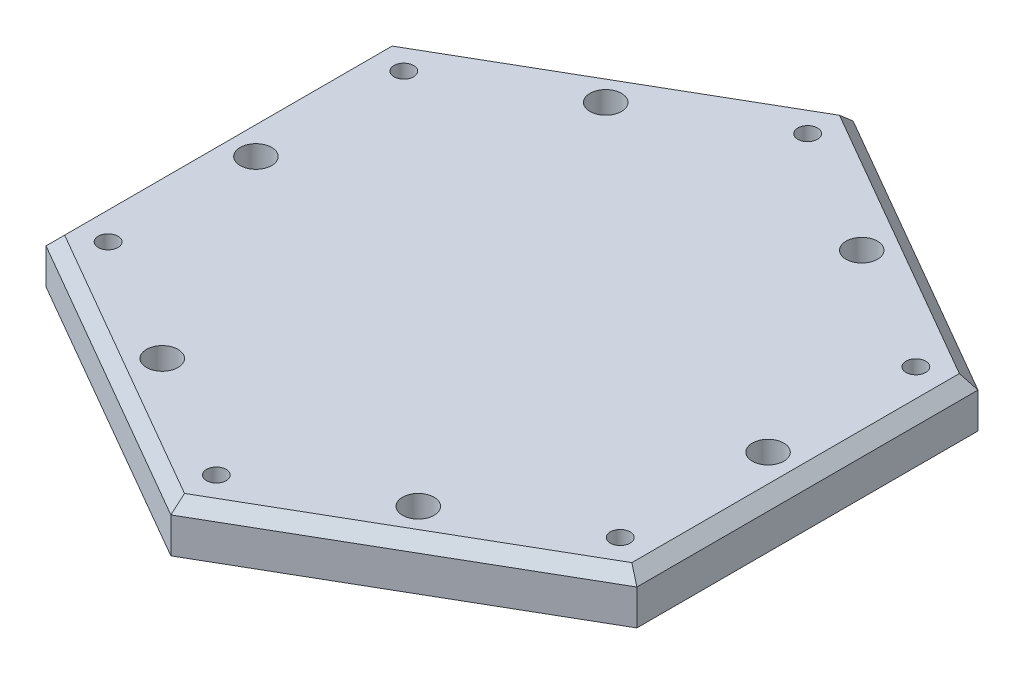
ISO-10303-21;
HEADER;
FILE_DESCRIPTION(('STEP AP214'),'2;1');
FILE_NAME('part.step','',(''),(''),'','','');
FILE_SCHEMA(('AUTOMOTIVE_DESIGN { 1 0 10303 214 1 1 1 1 }'));
ENDSEC;
DATA;
#1=APPLICATION_CONTEXT('core data for automotive mechanical design processes');
#2=APPLICATION_PROTOCOL_DEFINITION('international standard','automotive_design',2000,#1);
#3=PRODUCT_CONTEXT('',#1,'mechanical');
#4=PRODUCT('Part','Part','',(#3));
#5=PRODUCT_RELATED_PRODUCT_CATEGORY('part','',(#4));
#6=PRODUCT_DEFINITION_FORMATION('','',#4);
#7=PRODUCT_DEFINITION_CONTEXT('part definition',#1,'design');
#8=PRODUCT_DEFINITION('design','',#6,#7);
#9=PRODUCT_DEFINITION_SHAPE('','',#8);
#10=(LENGTH_UNIT() NAMED_UNIT(*) SI_UNIT(.MILLI.,.METRE.));
#11=(NAMED_UNIT(*) PLANE_ANGLE_UNIT() SI_UNIT($,.RADIAN.));
#12=(NAMED_UNIT(*) SI_UNIT($,.STERADIAN.) SOLID_ANGLE_UNIT());
#13=UNCERTAINTY_MEASURE_WITH_UNIT(LENGTH_MEASURE(1.E-05),#10,'distance_accuracy_value','');
#14=(GEOMETRIC_REPRESENTATION_CONTEXT(3) GLOBAL_UNCERTAINTY_ASSIGNED_CONTEXT((#13)) GLOBAL_UNIT_ASSIGNED_CONTEXT((#10,
#11,#12)) REPRESENTATION_CONTEXT('',''));
#15=CARTESIAN_POINT('',(0.,0.,0.));
#16=DIRECTION('',(0.,0.,1.));
#17=DIRECTION('',(1.,0.,0.));
#18=AXIS2_PLACEMENT_3D('',#15,#16,#17);
#19=CARTESIAN_POINT('',(75.,12.,-43.301270189222));
#20=DIRECTION('',(-0.5,0.,0.866025403784439));
#21=DIRECTION('',(0.866025403784439,0.,0.5));
#22=AXIS2_PLACEMENT_3D('',#19,#20,#21);
#23=PLANE('',#22);
#24=DIRECTION('',(0.,-1.,0.));
#25=VECTOR('',#24,1.);
#26=CARTESIAN_POINT('',(0.,12.,-86.6025403784439));
#27=LINE('',#26,#25);
#28=CARTESIAN_POINT('',(0.,8.99999999999997,-86.6025403784439));
#29=VERTEX_POINT('',#28);
#30=CARTESIAN_POINT('',(0.,0.,-86.6025403784439));
#31=VERTEX_POINT('',#30);
#32=EDGE_CURVE('E105',#29,#31,#27,.T.);
#33=ORIENTED_EDGE('',*,*,#32,.F.);
#34=DIRECTION('',(0.866025403784439,0.,0.5));
#35=VECTOR('',#34,1.);
#36=CARTESIAN_POINT('',(75.,8.99999999999997,-43.301270189222));
#37=LINE('',#36,#35);
#38=CARTESIAN_POINT('',(75.,8.99999999999997,-43.301270189222));
#39=VERTEX_POINT('',#38);
#40=EDGE_CURVE('E11',#29,#39,#37,.T.);
#41=ORIENTED_EDGE('',*,*,#40,.T.);
#42=DIRECTION('',(0.,-1.,0.));
#43=VECTOR('',#42,1.);
#44=CARTESIAN_POINT('',(75.,12.,-43.301270189222));
#45=LINE('',#44,#43);
#46=CARTESIAN_POINT('',(75.,0.,-43.301270189222));
#47=VERTEX_POINT('',#46);
#48=EDGE_CURVE('E126',#39,#47,#45,.T.);
#49=ORIENTED_EDGE('',*,*,#48,.T.);
#50=DIRECTION('',(-0.866025403784439,0.,-0.5));
#51=VECTOR('',#50,1.);
#52=CARTESIAN_POINT('',(75.,0.,-43.301270189222));
#53=LINE('',#52,#51);
#54=EDGE_CURVE('E120',#47,#31,#53,.T.);
#55=ORIENTED_EDGE('',*,*,#54,.T.);
#56=EDGE_LOOP('',(#33,#41,#49,#55));
#57=FACE_BOUND('',#56,.T.);
#58=ADVANCED_FACE('F35',(#57),#23,.F.);
#59=CARTESIAN_POINT('',(0.,12.,-86.6025403784439));
#60=DIRECTION('',(0.5,0.,0.866025403784439));
#61=DIRECTION('',(0.866025403784439,0.,-0.5));
#62=AXIS2_PLACEMENT_3D('',#59,#60,#61);
#63=PLANE('',#62);
#64=DIRECTION('',(0.,-1.,0.));
#65=VECTOR('',#64,1.);
#66=CARTESIAN_POINT('',(-75.,12.,-43.301270189222));
#67=LINE('',#66,#65);
#68=CARTESIAN_POINT('',(-75.,8.99999999999997,-43.301270189222));
#69=VERTEX_POINT('',#68);
#70=CARTESIAN_POINT('',(-75.,0.,-43.301270189222));
#71=VERTEX_POINT('',#70);
#72=EDGE_CURVE('E114',#69,#71,#67,.T.);
#73=ORIENTED_EDGE('',*,*,#72,.F.);
#74=DIRECTION('',(0.866025403784439,0.,-0.5));
#75=VECTOR('',#74,1.);
#76=CARTESIAN_POINT('',(0.,8.99999999999997,-86.6025403784439));
#77=LINE('',#76,#75);
#78=EDGE_CURVE('E44',#69,#29,#77,.T.);
#79=ORIENTED_EDGE('',*,*,#78,.T.);
#80=ORIENTED_EDGE('',*,*,#32,.T.);
#81=DIRECTION('',(-0.866025403784439,0.,0.5));
#82=VECTOR('',#81,1.);
#83=CARTESIAN_POINT('',(0.,0.,-86.6025403784439));
#84=LINE('',#83,#82);
#85=EDGE_CURVE('E108',#31,#71,#84,.T.);
#86=ORIENTED_EDGE('',*,*,#85,.T.);
#87=EDGE_LOOP('',(#73,#79,#80,#86));
#88=FACE_BOUND('',#87,.T.);
#89=ADVANCED_FACE('F107',(#88),#63,.F.);
#90=CARTESIAN_POINT('',(-75.,12.,-43.301270189222));
#91=DIRECTION('',(1.,0.,0.));
#92=DIRECTION('',(0.,0.,-1.));
#93=AXIS2_PLACEMENT_3D('',#90,#91,#92);
#94=PLANE('',#93);
#95=DIRECTION('',(0.,-1.,0.));
#96=VECTOR('',#95,1.);
#97=CARTESIAN_POINT('',(-75.,12.,43.3012701892219));
#98=LINE('',#97,#96);
#99=CARTESIAN_POINT('',(-75.,8.99999999999997,43.3012701892219));
#100=VERTEX_POINT('',#99);
#101=CARTESIAN_POINT('',(-75.,0.,43.3012701892219));
#102=VERTEX_POINT('',#101);
#103=EDGE_CURVE('E149',#100,#102,#98,.T.);
#104=ORIENTED_EDGE('',*,*,#103,.F.);
#105=DIRECTION('',(0.,0.,-1.));
#106=VECTOR('',#105,1.);
#107=CARTESIAN_POINT('',(-75.,8.99999999999997,-43.301270189222));
#108=LINE('',#107,#106);
#109=EDGE_CURVE('E59',#100,#69,#108,.T.);
#110=ORIENTED_EDGE('',*,*,#109,.T.);
#111=ORIENTED_EDGE('',*,*,#72,.T.);
#112=DIRECTION('',(0.,0.,1.));
#113=VECTOR('',#112,1.);
#114=CARTESIAN_POINT('',(-75.,0.,-43.301270189222));
#115=LINE('',#114,#113);
#116=EDGE_CURVE('E123',#71,#102,#115,.T.);
#117=ORIENTED_EDGE('',*,*,#116,.T.);
#118=EDGE_LOOP('',(#104,#110,#111,#117));
#119=FACE_BOUND('',#118,.T.);
#120=ADVANCED_FACE('F232',(#119),#94,.F.);
#121=CARTESIAN_POINT('',(-75.,12.,43.3012701892219));
#122=DIRECTION('',(0.5,0.,-0.866025403784439));
#123=DIRECTION('',(-0.866025403784439,0.,-0.5));
#124=AXIS2_PLACEMENT_3D('',#121,#122,#123);
#125=PLANE('',#124);
#126=DIRECTION('',(0.,-1.,0.));
#127=VECTOR('',#126,1.);
#128=CARTESIAN_POINT('',(0.,12.,86.6025403784438));
#129=LINE('',#128,#127);
#130=CARTESIAN_POINT('',(0.,8.99999999999997,86.6025403784438));
#131=VERTEX_POINT('',#130);
#132=CARTESIAN_POINT('',(0.,0.,86.6025403784438));
#133=VERTEX_POINT('',#132);
#134=EDGE_CURVE('E147',#131,#133,#129,.T.);
#135=ORIENTED_EDGE('',*,*,#134,.F.);
#136=DIRECTION('',(-0.866025403784439,0.,-0.5));
#137=VECTOR('',#136,1.);
#138=CARTESIAN_POINT('',(-75.,8.99999999999997,43.3012701892219));
#139=LINE('',#138,#137);
#140=EDGE_CURVE('E169',#131,#100,#139,.T.);
#141=ORIENTED_EDGE('',*,*,#140,.T.);
#142=ORIENTED_EDGE('',*,*,#103,.T.);
#143=DIRECTION('',(0.866025403784439,0.,0.5));
#144=VECTOR('',#143,1.);
#145=CARTESIAN_POINT('',(-75.,0.,43.3012701892219));
#146=LINE('',#145,#144);
#147=EDGE_CURVE('E136',#102,#133,#146,.T.);
#148=ORIENTED_EDGE('',*,*,#147,.T.);
#149=EDGE_LOOP('',(#135,#141,#142,#148));
#150=FACE_BOUND('',#149,.T.);
#151=ADVANCED_FACE('F217',(#150),#125,.F.);
#152=CARTESIAN_POINT('',(0.,12.,86.6025403784438));
#153=DIRECTION('',(-0.5,0.,-0.866025403784439));
#154=DIRECTION('',(-0.866025403784439,0.,0.5));
#155=AXIS2_PLACEMENT_3D('',#152,#153,#154);
#156=PLANE('',#155);
#157=DIRECTION('',(0.,-1.,0.));
#158=VECTOR('',#157,1.);
#159=CARTESIAN_POINT('',(75.,12.,43.301270189222));
#160=LINE('',#159,#158);
#161=CARTESIAN_POINT('',(75.,8.99999999999997,43.301270189222));
#162=VERTEX_POINT('',#161);
#163=CARTESIAN_POINT('',(75.,0.,43.301270189222));
#164=VERTEX_POINT('',#163);
#165=EDGE_CURVE('E145',#162,#164,#160,.T.);
#166=ORIENTED_EDGE('',*,*,#165,.F.);
#167=DIRECTION('',(-0.866025403784439,0.,0.5));
#168=VECTOR('',#167,1.);
#169=CARTESIAN_POINT('',(0.,8.99999999999997,86.6025403784438));
#170=LINE('',#169,#168);
#171=EDGE_CURVE('E167',#162,#131,#170,.T.);
#172=ORIENTED_EDGE('',*,*,#171,.T.);
#173=ORIENTED_EDGE('',*,*,#134,.T.);
#174=DIRECTION('',(0.866025403784439,0.,-0.5));
#175=VECTOR('',#174,1.);
#176=CARTESIAN_POINT('',(0.,0.,86.6025403784438));
#177=LINE('',#176,#175);
#178=EDGE_CURVE('E139',#133,#164,#177,.T.);
#179=ORIENTED_EDGE('',*,*,#178,.T.);
#180=EDGE_LOOP('',(#166,#172,#173,#179));
#181=FACE_BOUND('',#180,.T.);
#182=ADVANCED_FACE('F214',(#181),#156,.F.);
#183=CARTESIAN_POINT('',(75.,12.,43.301270189222));
#184=DIRECTION('',(-1.,0.,0.));
#185=DIRECTION('',(0.,0.,1.));
#186=AXIS2_PLACEMENT_3D('',#183,#184,#185);
#187=PLANE('',#186);
#188=ORIENTED_EDGE('',*,*,#48,.F.);
#189=DIRECTION('',(0.,0.,1.));
#190=VECTOR('',#189,1.);
#191=CARTESIAN_POINT('',(75.,8.99999999999997,43.301270189222));
#192=LINE('',#191,#190);
#193=EDGE_CURVE('E164',#39,#162,#192,.T.);
#194=ORIENTED_EDGE('',*,*,#193,.T.);
#195=ORIENTED_EDGE('',*,*,#165,.T.);
#196=DIRECTION('',(0.,0.,-1.));
#197=VECTOR('',#196,1.);
#198=CARTESIAN_POINT('',(75.,0.,43.301270189222));
#199=LINE('',#198,#197);
#200=EDGE_CURVE('E142',#164,#47,#199,.T.);
#201=ORIENTED_EDGE('',*,*,#200,.T.);
#202=EDGE_LOOP('',(#188,#194,#195,#201));
#203=FACE_BOUND('',#202,.T.);
#204=ADVANCED_FACE('F203',(#203),#187,.F.);
#205=CARTESIAN_POINT('',(0.,12.,0.));
#206=DIRECTION('',(0.,1.,0.));
#207=DIRECTION('',(0.,0.,1.));
#208=AXIS2_PLACEMENT_3D('',#205,#206,#207);
#209=PLANE('',#208);
#210=CARTESIAN_POINT('',(-65.,12.,-37.5277674973257));
#211=DIRECTION('',(0.,1.,0.));
#212=DIRECTION('',(0.,0.,1.));
#213=AXIS2_PLACEMENT_3D('',#210,#211,#212);
#214=CIRCLE('',#213,2.5);
#215=CARTESIAN_POINT('',(-65.,12.,-35.0277674973257));
#216=VERTEX_POINT('',#215);
#217=EDGE_CURVE('E469',#216,#216,#214,.T.);
#218=ORIENTED_EDGE('',*,*,#217,.F.);
#219=EDGE_LOOP('',(#218));
#220=FACE_BOUND('',#219,.T.);
#221=CARTESIAN_POINT('',(0.,12.,-75.0555349946514));
#222=DIRECTION('',(0.,1.,0.));
#223=DIRECTION('',(0.,0.,1.));
#224=AXIS2_PLACEMENT_3D('',#221,#222,#223);
#225=CIRCLE('',#224,2.5);
#226=CARTESIAN_POINT('',(0.,12.,-72.5555349946514));
#227=VERTEX_POINT('',#226);
#228=EDGE_CURVE('E473',#227,#227,#225,.T.);
#229=ORIENTED_EDGE('',*,*,#228,.F.);
#230=EDGE_LOOP('',(#229));
#231=FACE_BOUND('',#230,.T.);
#232=CARTESIAN_POINT('',(65.,12.,-37.5277674973257));
#233=DIRECTION('',(0.,1.,0.));
#234=DIRECTION('',(0.,0.,1.));
#235=AXIS2_PLACEMENT_3D('',#232,#233,#234);
#236=CIRCLE('',#235,2.5);
#237=CARTESIAN_POINT('',(65.,12.,-35.0277674973257));
#238=VERTEX_POINT('',#237);
#239=EDGE_CURVE('E477',#238,#238,#236,.T.);
#240=ORIENTED_EDGE('',*,*,#239,.F.);
#241=EDGE_LOOP('',(#240));
#242=FACE_BOUND('',#241,.T.);
#243=CARTESIAN_POINT('',(65.,12.,37.5277674973257));
#244=DIRECTION('',(0.,1.,0.));
#245=DIRECTION('',(0.,0.,1.));
#246=AXIS2_PLACEMENT_3D('',#243,#244,#245);
#247=CIRCLE('',#246,2.5);
#248=CARTESIAN_POINT('',(65.,12.,40.0277674973257));
#249=VERTEX_POINT('',#248);
#250=EDGE_CURVE('E481',#249,#249,#247,.T.);
#251=ORIENTED_EDGE('',*,*,#250,.F.);
#252=EDGE_LOOP('',(#251));
#253=FACE_BOUND('',#252,.T.);
#254=CARTESIAN_POINT('',(0.,12.,75.0555349946513));
#255=DIRECTION('',(0.,1.,0.));
#256=DIRECTION('',(0.,0.,1.));
#257=AXIS2_PLACEMENT_3D('',#254,#255,#256);
#258=CIRCLE('',#257,2.5);
#259=CARTESIAN_POINT('',(0.,12.,77.5555349946513));
#260=VERTEX_POINT('',#259);
#261=EDGE_CURVE('E485',#260,#260,#258,.T.);
#262=ORIENTED_EDGE('',*,*,#261,.F.);
#263=EDGE_LOOP('',(#262));
#264=FACE_BOUND('',#263,.T.);
#265=CARTESIAN_POINT('',(-65.,12.,37.5277674973257));
#266=DIRECTION('',(0.,1.,0.));
#267=DIRECTION('',(0.,0.,1.));
#268=AXIS2_PLACEMENT_3D('',#265,#266,#267);
#269=CIRCLE('',#268,2.5);
#270=CARTESIAN_POINT('',(-65.,12.,40.0277674973257));
#271=VERTEX_POINT('',#270);
#272=EDGE_CURVE('E489',#271,#271,#269,.T.);
#273=ORIENTED_EDGE('',*,*,#272,.F.);
#274=EDGE_LOOP('',(#273));
#275=FACE_BOUND('',#274,.T.);
#276=CARTESIAN_POINT('',(-32.5,12.,-56.2916512459885));
#277=DIRECTION('',(0.,1.,0.));
#278=DIRECTION('',(0.,0.,1.));
#279=AXIS2_PLACEMENT_3D('',#276,#277,#278);
#280=CIRCLE('',#279,4.);
#281=CARTESIAN_POINT('',(-32.5,12.,-52.2916512459885));
#282=VERTEX_POINT('',#281);
#283=EDGE_CURVE('E493',#282,#282,#280,.T.);
#284=ORIENTED_EDGE('',*,*,#283,.F.);
#285=EDGE_LOOP('',(#284));
#286=FACE_BOUND('',#285,.T.);
#287=CARTESIAN_POINT('',(32.5,12.,-56.2916512459886));
#288=DIRECTION('',(0.,1.,0.));
#289=DIRECTION('',(0.,0.,1.));
#290=AXIS2_PLACEMENT_3D('',#287,#288,#289);
#291=CIRCLE('',#290,4.);
#292=CARTESIAN_POINT('',(32.5,12.,-52.2916512459886));
#293=VERTEX_POINT('',#292);
#294=EDGE_CURVE('E497',#293,#293,#291,.T.);
#295=ORIENTED_EDGE('',*,*,#294,.F.);
#296=EDGE_LOOP('',(#295));
#297=FACE_BOUND('',#296,.T.);
#298=CARTESIAN_POINT('',(65.,12.,0.));
#299=DIRECTION('',(0.,1.,0.));
#300=DIRECTION('',(0.,0.,1.));
#301=AXIS2_PLACEMENT_3D('',#298,#299,#300);
#302=CIRCLE('',#301,4.00000000000001);
#303=CARTESIAN_POINT('',(65.,12.,3.99999999999999));
#304=VERTEX_POINT('',#303);
#305=EDGE_CURVE('E501',#304,#304,#302,.T.);
#306=ORIENTED_EDGE('',*,*,#305,.F.);
#307=EDGE_LOOP('',(#306));
#308=FACE_BOUND('',#307,.T.);
#309=CARTESIAN_POINT('',(32.5,12.,56.2916512459885));
#310=DIRECTION('',(0.,1.,0.));
#311=DIRECTION('',(0.,0.,1.));
#312=AXIS2_PLACEMENT_3D('',#309,#310,#311);
#313=CIRCLE('',#312,4.);
#314=CARTESIAN_POINT('',(32.5,12.,60.2916512459885));
#315=VERTEX_POINT('',#314);
#316=EDGE_CURVE('E505',#315,#315,#313,.T.);
#317=ORIENTED_EDGE('',*,*,#316,.F.);
#318=EDGE_LOOP('',(#317));
#319=FACE_BOUND('',#318,.T.);
#320=CARTESIAN_POINT('',(-32.5,12.,56.2916512459885));
#321=DIRECTION('',(0.,1.,0.));
#322=DIRECTION('',(0.,0.,1.));
#323=AXIS2_PLACEMENT_3D('',#320,#321,#322);
#324=CIRCLE('',#323,4.);
#325=CARTESIAN_POINT('',(-32.5,12.,60.2916512459885));
#326=VERTEX_POINT('',#325);
#327=EDGE_CURVE('E509',#326,#326,#324,.T.);
#328=ORIENTED_EDGE('',*,*,#327,.F.);
#329=EDGE_LOOP('',(#328));
#330=FACE_BOUND('',#329,.T.);
#331=CARTESIAN_POINT('',(-65.,12.,0.));
#332=DIRECTION('',(0.,1.,0.));
#333=DIRECTION('',(0.,0.,1.));
#334=AXIS2_PLACEMENT_3D('',#331,#332,#333);
#335=CIRCLE('',#334,4.00000000000001);
#336=CARTESIAN_POINT('',(-65.,12.,3.99999999999998));
#337=VERTEX_POINT('',#336);
#338=EDGE_CURVE('E132',#337,#337,#335,.T.);
#339=ORIENTED_EDGE('',*,*,#338,.F.);
#340=EDGE_LOOP('',(#339));
#341=FACE_BOUND('',#340,.T.);
#342=DIRECTION('',(0.866025403784439,0.,-0.5));
#343=VECTOR('',#342,1.);
#344=CARTESIAN_POINT('',(73.5,12.,40.7031939778687));
#345=LINE('',#344,#343);
#346=CARTESIAN_POINT('',(0.,12.,83.1384387633061));
#347=VERTEX_POINT('',#346);
#348=CARTESIAN_POINT('',(72.,12.,41.5692193816531));
#349=VERTEX_POINT('',#348);
#350=EDGE_CURVE('E159',#347,#349,#345,.T.);
#351=ORIENTED_EDGE('',*,*,#350,.T.);
#352=DIRECTION('',(0.,0.,-1.));
#353=VECTOR('',#352,1.);
#354=CARTESIAN_POINT('',(72.,12.,-43.301270189222));
#355=LINE('',#354,#353);
#356=CARTESIAN_POINT('',(72.,12.,-41.5692193816531));
#357=VERTEX_POINT('',#356);
#358=EDGE_CURVE('E161',#349,#357,#355,.T.);
#359=ORIENTED_EDGE('',*,*,#358,.T.);
#360=DIRECTION('',(-0.866025403784439,0.,-0.5));
#361=VECTOR('',#360,1.);
#362=CARTESIAN_POINT('',(-1.50000000000001,12.,-84.0044641670906));
#363=LINE('',#362,#361);
#364=CARTESIAN_POINT('',(0.,12.,-83.1384387633062));
#365=VERTEX_POINT('',#364);
#366=EDGE_CURVE('E113',#357,#365,#363,.T.);
#367=ORIENTED_EDGE('',*,*,#366,.T.);
#368=DIRECTION('',(-0.866025403784439,0.,0.5));
#369=VECTOR('',#368,1.);
#370=CARTESIAN_POINT('',(-73.5,12.,-40.7031939778687));
#371=LINE('',#370,#369);
#372=CARTESIAN_POINT('',(-72.,12.,-41.5692193816531));
#373=VERTEX_POINT('',#372);
#374=EDGE_CURVE('E153',#365,#373,#371,.T.);
#375=ORIENTED_EDGE('',*,*,#374,.T.);
#376=DIRECTION('',(0.,0.,1.));
#377=VECTOR('',#376,1.);
#378=CARTESIAN_POINT('',(-72.,12.,43.3012701892219));
#379=LINE('',#378,#377);
#380=CARTESIAN_POINT('',(-72.,12.,41.569219381653));
#381=VERTEX_POINT('',#380);
#382=EDGE_CURVE('E155',#373,#381,#379,.T.);
#383=ORIENTED_EDGE('',*,*,#382,.T.);
#384=DIRECTION('',(0.866025403784439,0.,0.5));
#385=VECTOR('',#384,1.);
#386=CARTESIAN_POINT('',(1.49999999999998,12.,84.0044641670905));
#387=LINE('',#386,#385);
#388=EDGE_CURVE('E157',#381,#347,#387,.T.);
#389=ORIENTED_EDGE('',*,*,#388,.T.);
#390=EDGE_LOOP('',(#351,#359,#367,#375,#383,#389));
#391=FACE_BOUND('',#390,.T.);
#392=ADVANCED_FACE('F193',(#220,#231,#242,#253,#264,#275,#286,#297,#308,#319,#330,#341,#391),
#209,.T.);
#393=CARTESIAN_POINT('',(0.,0.,0.));
#394=DIRECTION('',(0.,1.,0.));
#395=DIRECTION('',(0.,0.,1.));
#396=AXIS2_PLACEMENT_3D('',#393,#394,#395);
#397=PLANE('',#396);
#398=CARTESIAN_POINT('',(-65.,0.,-37.5277674973257));
#399=DIRECTION('',(0.,1.,0.));
#400=DIRECTION('',(0.,0.,1.));
#401=AXIS2_PLACEMENT_3D('',#398,#399,#400);
#402=CIRCLE('',#401,2.5);
#403=CARTESIAN_POINT('',(-65.,0.,-35.0277674973257));
#404=VERTEX_POINT('',#403);
#405=EDGE_CURVE('E561',#404,#404,#402,.T.);
#406=ORIENTED_EDGE('',*,*,#405,.T.);
#407=EDGE_LOOP('',(#406));
#408=FACE_BOUND('',#407,.T.);
#409=CARTESIAN_POINT('',(0.,0.,-75.0555349946514));
#410=DIRECTION('',(0.,1.,0.));
#411=DIRECTION('',(0.,0.,1.));
#412=AXIS2_PLACEMENT_3D('',#409,#410,#411);
#413=CIRCLE('',#412,2.5);
#414=CARTESIAN_POINT('',(0.,0.,-72.5555349946514));
#415=VERTEX_POINT('',#414);
#416=EDGE_CURVE('E557',#415,#415,#413,.T.);
#417=ORIENTED_EDGE('',*,*,#416,.T.);
#418=EDGE_LOOP('',(#417));
#419=FACE_BOUND('',#418,.T.);
#420=CARTESIAN_POINT('',(65.,0.,-37.5277674973257));
#421=DIRECTION('',(0.,1.,0.));
#422=DIRECTION('',(0.,0.,1.));
#423=AXIS2_PLACEMENT_3D('',#420,#421,#422);
#424=CIRCLE('',#423,2.5);
#425=CARTESIAN_POINT('',(65.,0.,-35.0277674973257));
#426=VERTEX_POINT('',#425);
#427=EDGE_CURVE('E553',#426,#426,#424,.T.);
#428=ORIENTED_EDGE('',*,*,#427,.T.);
#429=EDGE_LOOP('',(#428));
#430=FACE_BOUND('',#429,.T.);
#431=CARTESIAN_POINT('',(65.,0.,37.5277674973257));
#432=DIRECTION('',(0.,1.,0.));
#433=DIRECTION('',(0.,0.,1.));
#434=AXIS2_PLACEMENT_3D('',#431,#432,#433);
#435=CIRCLE('',#434,2.5);
#436=CARTESIAN_POINT('',(65.,0.,40.0277674973257));
#437=VERTEX_POINT('',#436);
#438=EDGE_CURVE('E549',#437,#437,#435,.T.);
#439=ORIENTED_EDGE('',*,*,#438,.T.);
#440=EDGE_LOOP('',(#439));
#441=FACE_BOUND('',#440,.T.);
#442=CARTESIAN_POINT('',(0.,0.,75.0555349946513));
#443=DIRECTION('',(0.,1.,0.));
#444=DIRECTION('',(0.,0.,1.));
#445=AXIS2_PLACEMENT_3D('',#442,#443,#444);
#446=CIRCLE('',#445,2.5);
#447=CARTESIAN_POINT('',(0.,0.,77.5555349946513));
#448=VERTEX_POINT('',#447);
#449=EDGE_CURVE('E543',#448,#448,#446,.T.);
#450=ORIENTED_EDGE('',*,*,#449,.T.);
#451=EDGE_LOOP('',(#450));
#452=FACE_BOUND('',#451,.T.);
#453=CARTESIAN_POINT('',(-65.,0.,37.5277674973257));
#454=DIRECTION('',(0.,1.,0.));
#455=DIRECTION('',(0.,0.,1.));
#456=AXIS2_PLACEMENT_3D('',#453,#454,#455);
#457=CIRCLE('',#456,2.5);
#458=CARTESIAN_POINT('',(-65.,0.,40.0277674973257));
#459=VERTEX_POINT('',#458);
#460=EDGE_CURVE('E520',#459,#459,#457,.T.);
#461=ORIENTED_EDGE('',*,*,#460,.T.);
#462=EDGE_LOOP('',(#461));
#463=FACE_BOUND('',#462,.T.);
#464=CARTESIAN_POINT('',(-32.5,0.,-56.2916512459885));
#465=DIRECTION('',(0.,1.,0.));
#466=DIRECTION('',(0.,0.,1.));
#467=AXIS2_PLACEMENT_3D('',#464,#465,#466);
#468=CIRCLE('',#467,4.);
#469=CARTESIAN_POINT('',(-32.5,0.,-52.2916512459885));
#470=VERTEX_POINT('',#469);
#471=EDGE_CURVE('E514',#470,#470,#468,.T.);
#472=ORIENTED_EDGE('',*,*,#471,.T.);
#473=EDGE_LOOP('',(#472));
#474=FACE_BOUND('',#473,.T.);
#475=CARTESIAN_POINT('',(32.5,0.,-56.2916512459886));
#476=DIRECTION('',(0.,1.,0.));
#477=DIRECTION('',(0.,0.,1.));
#478=AXIS2_PLACEMENT_3D('',#475,#476,#477);
#479=CIRCLE('',#478,4.);
#480=CARTESIAN_POINT('',(32.5,0.,-52.2916512459886));
#481=VERTEX_POINT('',#480);
#482=EDGE_CURVE('E524',#481,#481,#479,.T.);
#483=ORIENTED_EDGE('',*,*,#482,.T.);
#484=EDGE_LOOP('',(#483));
#485=FACE_BOUND('',#484,.T.);
#486=CARTESIAN_POINT('',(65.,0.,0.));
#487=DIRECTION('',(0.,1.,0.));
#488=DIRECTION('',(0.,0.,1.));
#489=AXIS2_PLACEMENT_3D('',#486,#487,#488);
#490=CIRCLE('',#489,4.00000000000001);
#491=CARTESIAN_POINT('',(65.,0.,3.99999999999999));
#492=VERTEX_POINT('',#491);
#493=EDGE_CURVE('E528',#492,#492,#490,.T.);
#494=ORIENTED_EDGE('',*,*,#493,.T.);
#495=EDGE_LOOP('',(#494));
#496=FACE_BOUND('',#495,.T.);
#497=CARTESIAN_POINT('',(32.5,0.,56.2916512459885));
#498=DIRECTION('',(0.,1.,0.));
#499=DIRECTION('',(0.,0.,1.));
#500=AXIS2_PLACEMENT_3D('',#497,#498,#499);
#501=CIRCLE('',#500,4.);
#502=CARTESIAN_POINT('',(32.5,0.,60.2916512459885));
#503=VERTEX_POINT('',#502);
#504=EDGE_CURVE('E532',#503,#503,#501,.T.);
#505=ORIENTED_EDGE('',*,*,#504,.T.);
#506=EDGE_LOOP('',(#505));
#507=FACE_BOUND('',#506,.T.);
#508=CARTESIAN_POINT('',(-32.5,0.,56.2916512459885));
#509=DIRECTION('',(0.,1.,0.));
#510=DIRECTION('',(0.,0.,1.));
#511=AXIS2_PLACEMENT_3D('',#508,#509,#510);
#512=CIRCLE('',#511,4.);
#513=CARTESIAN_POINT('',(-32.5,0.,60.2916512459885));
#514=VERTEX_POINT('',#513);
#515=EDGE_CURVE('E536',#514,#514,#512,.T.);
#516=ORIENTED_EDGE('',*,*,#515,.T.);
#517=EDGE_LOOP('',(#516));
#518=FACE_BOUND('',#517,.T.);
#519=CARTESIAN_POINT('',(-65.,0.,0.));
#520=DIRECTION('',(0.,1.,0.));
#521=DIRECTION('',(0.,0.,1.));
#522=AXIS2_PLACEMENT_3D('',#519,#520,#521);
#523=CIRCLE('',#522,4.00000000000001);
#524=CARTESIAN_POINT('',(-65.,0.,3.99999999999998));
#525=VERTEX_POINT('',#524);
#526=EDGE_CURVE('E176',#525,#525,#523,.T.);
#527=ORIENTED_EDGE('',*,*,#526,.T.);
#528=EDGE_LOOP('',(#527));
#529=FACE_BOUND('',#528,.T.);
#530=ORIENTED_EDGE('',*,*,#54,.F.);
#531=ORIENTED_EDGE('',*,*,#200,.F.);
#532=ORIENTED_EDGE('',*,*,#178,.F.);
#533=ORIENTED_EDGE('',*,*,#147,.F.);
#534=ORIENTED_EDGE('',*,*,#116,.F.);
#535=ORIENTED_EDGE('',*,*,#85,.F.);
#536=EDGE_LOOP('',(#530,#531,#532,#533,#534,#535));
#537=FACE_BOUND('',#536,.T.);
#538=ADVANCED_FACE('F118',(#408,#419,#430,#441,#452,#463,#474,#485,#496,#507,#518,#529,#537),
#397,.F.);
#539=CARTESIAN_POINT('',(-72.,12.,0.));
#540=DIRECTION('',(-0.707106781186552,0.707106781186543,0.));
#541=DIRECTION('',(0.,0.,-1.));
#542=AXIS2_PLACEMENT_3D('',#539,#540,#541);
#543=PLANE('',#542);
#544=DIRECTION('',(0.654653670707974,0.654653670707983,0.377964473009223));
#545=VECTOR('',#544,1.);
#546=CARTESIAN_POINT('',(-61.7142857142858,22.2857142857144,-35.6307594699885));
#547=LINE('',#546,#545);
#548=EDGE_CURVE('E130',#69,#373,#547,.T.);
#549=ORIENTED_EDGE('',*,*,#548,.F.);
#550=ORIENTED_EDGE('',*,*,#109,.F.);
#551=DIRECTION('',(0.654653670707974,0.654653670707983,-0.377964473009223));
#552=VECTOR('',#551,1.);
#553=CARTESIAN_POINT('',(-61.7142857142859,22.2857142857143,35.6307594699885));
#554=LINE('',#553,#552);
#555=EDGE_CURVE('E39',#381,#100,#554,.F.);
#556=ORIENTED_EDGE('',*,*,#555,.F.);
#557=ORIENTED_EDGE('',*,*,#382,.F.);
#558=EDGE_LOOP('',(#549,#550,#556,#557));
#559=FACE_BOUND('',#558,.T.);
#560=ADVANCED_FACE('F37',(#559),#543,.T.);
#561=CARTESIAN_POINT('',(-36.,12.,62.3538290724796));
#562=DIRECTION('',(-0.353553390593277,0.707106781186541,0.6123724356958));
#563=DIRECTION('',(-0.866025403784439,0.,-0.5));
#564=AXIS2_PLACEMENT_3D('',#561,#562,#563);
#565=PLANE('',#564);
#566=ORIENTED_EDGE('',*,*,#555,.T.);
#567=ORIENTED_EDGE('',*,*,#140,.F.);
#568=DIRECTION('',(0.,0.654653670707984,-0.755928946018449));
#569=VECTOR('',#568,1.);
#570=CARTESIAN_POINT('',(0.,22.2857142857143,71.2615189399769));
#571=LINE('',#570,#569);
#572=EDGE_CURVE('E181',#347,#131,#571,.F.);
#573=ORIENTED_EDGE('',*,*,#572,.F.);
#574=ORIENTED_EDGE('',*,*,#388,.F.);
#575=EDGE_LOOP('',(#566,#567,#573,#574));
#576=FACE_BOUND('',#575,.T.);
#577=ADVANCED_FACE('F220',(#576),#565,.T.);
#578=CARTESIAN_POINT('',(-36.,12.,-62.3538290724796));
#579=DIRECTION('',(-0.353553390593277,0.707106781186541,-0.6123724356958));
#580=DIRECTION('',(0.866025403784439,0.,-0.5));
#581=AXIS2_PLACEMENT_3D('',#578,#579,#580);
#582=PLANE('',#581);
#583=ORIENTED_EDGE('',*,*,#548,.T.);
#584=ORIENTED_EDGE('',*,*,#374,.F.);
#585=DIRECTION('',(0.,0.654653670707983,0.75592894601845));
#586=VECTOR('',#585,1.);
#587=CARTESIAN_POINT('',(0.,22.2857142857142,-71.2615189399769));
#588=LINE('',#587,#586);
#589=EDGE_CURVE('E178',#29,#365,#588,.T.);
#590=ORIENTED_EDGE('',*,*,#589,.F.);
#591=ORIENTED_EDGE('',*,*,#78,.F.);
#592=EDGE_LOOP('',(#583,#584,#590,#591));
#593=FACE_BOUND('',#592,.T.);
#594=ADVANCED_FACE('F187',(#593),#582,.T.);
#595=CARTESIAN_POINT('',(36.,12.,62.3538290724796));
#596=DIRECTION('',(0.353553390593277,0.707106781186541,0.6123724356958));
#597=DIRECTION('',(-0.866025403784439,0.,0.5));
#598=AXIS2_PLACEMENT_3D('',#595,#596,#597);
#599=PLANE('',#598);
#600=ORIENTED_EDGE('',*,*,#572,.T.);
#601=ORIENTED_EDGE('',*,*,#171,.F.);
#602=DIRECTION('',(-0.654653670707974,0.654653670707983,-0.377964473009223));
#603=VECTOR('',#602,1.);
#604=CARTESIAN_POINT('',(61.7142857142858,22.2857142857144,35.6307594699885));
#605=LINE('',#604,#603);
#606=EDGE_CURVE('E175',#349,#162,#605,.F.);
#607=ORIENTED_EDGE('',*,*,#606,.F.);
#608=ORIENTED_EDGE('',*,*,#350,.F.);
#609=EDGE_LOOP('',(#600,#601,#607,#608));
#610=FACE_BOUND('',#609,.T.);
#611=ADVANCED_FACE('F211',(#610),#599,.T.);
#612=CARTESIAN_POINT('',(36.,12.,-62.3538290724796));
#613=DIRECTION('',(0.353553390593276,0.707106781186543,-0.612372435695798));
#614=DIRECTION('',(0.866025403784439,0.,0.5));
#615=AXIS2_PLACEMENT_3D('',#612,#613,#614);
#616=PLANE('',#615);
#617=ORIENTED_EDGE('',*,*,#589,.T.);
#618=ORIENTED_EDGE('',*,*,#366,.F.);
#619=DIRECTION('',(0.654653670707973,-0.654653670707982,-0.377964473009226));
#620=VECTOR('',#619,1.);
#621=CARTESIAN_POINT('',(61.7142857142859,22.2857142857143,-35.6307594699884));
#622=LINE('',#621,#620);
#623=EDGE_CURVE('E173',#39,#357,#622,.F.);
#624=ORIENTED_EDGE('',*,*,#623,.F.);
#625=ORIENTED_EDGE('',*,*,#40,.F.);
#626=EDGE_LOOP('',(#617,#618,#624,#625));
#627=FACE_BOUND('',#626,.T.);
#628=ADVANCED_FACE('F199',(#627),#616,.T.);
#629=CARTESIAN_POINT('',(72.,12.,0.));
#630=DIRECTION('',(0.707106781186552,0.707106781186543,0.));
#631=DIRECTION('',(0.,0.,1.));
#632=AXIS2_PLACEMENT_3D('',#629,#630,#631);
#633=PLANE('',#632);
#634=ORIENTED_EDGE('',*,*,#606,.T.);
#635=ORIENTED_EDGE('',*,*,#193,.F.);
#636=ORIENTED_EDGE('',*,*,#623,.T.);
#637=ORIENTED_EDGE('',*,*,#358,.F.);
#638=EDGE_LOOP('',(#634,#635,#636,#637));
#639=FACE_BOUND('',#638,.T.);
#640=ADVANCED_FACE('F206',(#639),#633,.T.);
#641=CARTESIAN_POINT('',(-65.,0.,0.));
#642=DIRECTION('',(0.,1.,0.));
#643=DIRECTION('',(0.,0.,1.));
#644=AXIS2_PLACEMENT_3D('',#641,#642,#643);
#645=CYLINDRICAL_SURFACE('',#644,4.00000000000001);
#646=ORIENTED_EDGE('',*,*,#526,.F.);
#647=EDGE_LOOP('',(#646));
#648=FACE_BOUND('',#647,.T.);
#649=ORIENTED_EDGE('',*,*,#338,.T.);
#650=EDGE_LOOP('',(#649));
#651=FACE_BOUND('',#650,.T.);
#652=ADVANCED_FACE('F238',(#648,#651),#645,.F.);
#653=CARTESIAN_POINT('',(-32.5,0.,56.2916512459885));
#654=DIRECTION('',(0.,1.,0.));
#655=DIRECTION('',(0.,0.,1.));
#656=AXIS2_PLACEMENT_3D('',#653,#654,#655);
#657=CYLINDRICAL_SURFACE('',#656,4.);
#658=ORIENTED_EDGE('',*,*,#515,.F.);
#659=EDGE_LOOP('',(#658));
#660=FACE_BOUND('',#659,.T.);
#661=ORIENTED_EDGE('',*,*,#327,.T.);
#662=EDGE_LOOP('',(#661));
#663=FACE_BOUND('',#662,.T.);
#664=ADVANCED_FACE('F260',(#660,#663),#657,.F.);
#665=CARTESIAN_POINT('',(32.5,0.,56.2916512459885));
#666=DIRECTION('',(0.,1.,0.));
#667=DIRECTION('',(0.,0.,1.));
#668=AXIS2_PLACEMENT_3D('',#665,#666,#667);
#669=CYLINDRICAL_SURFACE('',#668,4.);
#670=ORIENTED_EDGE('',*,*,#504,.F.);
#671=EDGE_LOOP('',(#670));
#672=FACE_BOUND('',#671,.T.);
#673=ORIENTED_EDGE('',*,*,#316,.T.);
#674=EDGE_LOOP('',(#673));
#675=FACE_BOUND('',#674,.T.);
#676=ADVANCED_FACE('F268',(#672,#675),#669,.F.);
#677=CARTESIAN_POINT('',(65.,0.,0.));
#678=DIRECTION('',(0.,1.,0.));
#679=DIRECTION('',(0.,0.,1.));
#680=AXIS2_PLACEMENT_3D('',#677,#678,#679);
#681=CYLINDRICAL_SURFACE('',#680,4.00000000000001);
#682=ORIENTED_EDGE('',*,*,#493,.F.);
#683=EDGE_LOOP('',(#682));
#684=FACE_BOUND('',#683,.T.);
#685=ORIENTED_EDGE('',*,*,#305,.T.);
#686=EDGE_LOOP('',(#685));
#687=FACE_BOUND('',#686,.T.);
#688=ADVANCED_FACE('F276',(#684,#687),#681,.F.);
#689=CARTESIAN_POINT('',(32.5,0.,-56.2916512459886));
#690=DIRECTION('',(0.,1.,0.));
#691=DIRECTION('',(0.,0.,1.));
#692=AXIS2_PLACEMENT_3D('',#689,#690,#691);
#693=CYLINDRICAL_SURFACE('',#692,4.);
#694=ORIENTED_EDGE('',*,*,#482,.F.);
#695=EDGE_LOOP('',(#694));
#696=FACE_BOUND('',#695,.T.);
#697=ORIENTED_EDGE('',*,*,#294,.T.);
#698=EDGE_LOOP('',(#697));
#699=FACE_BOUND('',#698,.T.);
#700=ADVANCED_FACE('F284',(#696,#699),#693,.F.);
#701=CARTESIAN_POINT('',(-32.5,0.,-56.2916512459885));
#702=DIRECTION('',(0.,1.,0.));
#703=DIRECTION('',(0.,0.,1.));
#704=AXIS2_PLACEMENT_3D('',#701,#702,#703);
#705=CYLINDRICAL_SURFACE('',#704,4.);
#706=ORIENTED_EDGE('',*,*,#471,.F.);
#707=EDGE_LOOP('',(#706));
#708=FACE_BOUND('',#707,.T.);
#709=ORIENTED_EDGE('',*,*,#283,.T.);
#710=EDGE_LOOP('',(#709));
#711=FACE_BOUND('',#710,.T.);
#712=ADVANCED_FACE('F292',(#708,#711),#705,.F.);
#713=CARTESIAN_POINT('',(-65.,12.,37.5277674973257));
#714=DIRECTION('',(0.,1.,0.));
#715=DIRECTION('',(0.,0.,1.));
#716=AXIS2_PLACEMENT_3D('',#713,#714,#715);
#717=CYLINDRICAL_SURFACE('',#716,2.5);
#718=ORIENTED_EDGE('',*,*,#460,.F.);
#719=EDGE_LOOP('',(#718));
#720=FACE_BOUND('',#719,.T.);
#721=ORIENTED_EDGE('',*,*,#272,.T.);
#722=EDGE_LOOP('',(#721));
#723=FACE_BOUND('',#722,.T.);
#724=ADVANCED_FACE('F300',(#720,#723),#717,.F.);
#725=CARTESIAN_POINT('',(0.,12.,75.0555349946513));
#726=DIRECTION('',(0.,1.,0.));
#727=DIRECTION('',(0.,0.,1.));
#728=AXIS2_PLACEMENT_3D('',#725,#726,#727);
#729=CYLINDRICAL_SURFACE('',#728,2.5);
#730=ORIENTED_EDGE('',*,*,#449,.F.);
#731=EDGE_LOOP('',(#730));
#732=FACE_BOUND('',#731,.T.);
#733=ORIENTED_EDGE('',*,*,#261,.T.);
#734=EDGE_LOOP('',(#733));
#735=FACE_BOUND('',#734,.T.);
#736=ADVANCED_FACE('F309',(#732,#735),#729,.F.);
#737=CARTESIAN_POINT('',(65.,12.,37.5277674973257));
#738=DIRECTION('',(0.,1.,0.));
#739=DIRECTION('',(0.,0.,1.));
#740=AXIS2_PLACEMENT_3D('',#737,#738,#739);
#741=CYLINDRICAL_SURFACE('',#740,2.5);
#742=ORIENTED_EDGE('',*,*,#438,.F.);
#743=EDGE_LOOP('',(#742));
#744=FACE_BOUND('',#743,.T.);
#745=ORIENTED_EDGE('',*,*,#250,.T.);
#746=EDGE_LOOP('',(#745));
#747=FACE_BOUND('',#746,.T.);
#748=ADVANCED_FACE('F317',(#744,#747),#741,.F.);
#749=CARTESIAN_POINT('',(65.,12.,-37.5277674973257));
#750=DIRECTION('',(0.,1.,0.));
#751=DIRECTION('',(0.,0.,1.));
#752=AXIS2_PLACEMENT_3D('',#749,#750,#751);
#753=CYLINDRICAL_SURFACE('',#752,2.5);
#754=ORIENTED_EDGE('',*,*,#427,.F.);
#755=EDGE_LOOP('',(#754));
#756=FACE_BOUND('',#755,.T.);
#757=ORIENTED_EDGE('',*,*,#239,.T.);
#758=EDGE_LOOP('',(#757));
#759=FACE_BOUND('',#758,.T.);
#760=ADVANCED_FACE('F325',(#756,#759),#753,.F.);
#761=CARTESIAN_POINT('',(0.,12.,-75.0555349946514));
#762=DIRECTION('',(0.,1.,0.));
#763=DIRECTION('',(0.,0.,1.));
#764=AXIS2_PLACEMENT_3D('',#761,#762,#763);
#765=CYLINDRICAL_SURFACE('',#764,2.5);
#766=ORIENTED_EDGE('',*,*,#416,.F.);
#767=EDGE_LOOP('',(#766));
#768=FACE_BOUND('',#767,.T.);
#769=ORIENTED_EDGE('',*,*,#228,.T.);
#770=EDGE_LOOP('',(#769));
#771=FACE_BOUND('',#770,.T.);
#772=ADVANCED_FACE('F333',(#768,#771),#765,.F.);
#773=CARTESIAN_POINT('',(-65.,12.,-37.5277674973257));
#774=DIRECTION('',(0.,1.,0.));
#775=DIRECTION('',(0.,0.,1.));
#776=AXIS2_PLACEMENT_3D('',#773,#774,#775);
#777=CYLINDRICAL_SURFACE('',#776,2.5);
#778=ORIENTED_EDGE('',*,*,#405,.F.);
#779=EDGE_LOOP('',(#778));
#780=FACE_BOUND('',#779,.T.);
#781=ORIENTED_EDGE('',*,*,#217,.T.);
#782=EDGE_LOOP('',(#781));
#783=FACE_BOUND('',#782,.T.);
#784=ADVANCED_FACE('F341',(#780,#783),#777,.F.);
#785=CLOSED_SHELL('',(#58,#89,#120,#151,#182,#204,#392,#538,#560,#577,#594,#611,#628,#640,#652,
#664,#676,#688,#700,#712,#724,#736,#748,#760,#772,#784));
#786=MANIFOLD_SOLID_BREP('B2',#785);
#787=ADVANCED_BREP_SHAPE_REPRESENTATION('',(#18,#786),#14);
#788=SHAPE_DEFINITION_REPRESENTATION(#9,#787);
ENDSEC;
END-ISO-10303-21;
